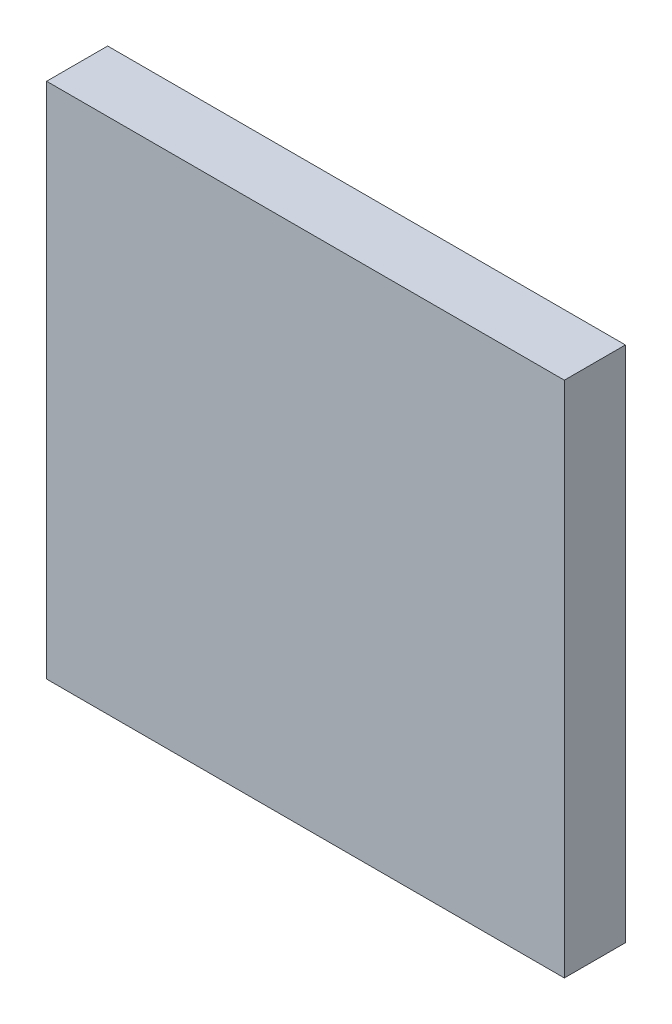
ISO-10303-21;
HEADER;
FILE_DESCRIPTION(('STEP AP214'),'2;1');
FILE_NAME('part.step','',(''),(''),'','','');
FILE_SCHEMA(('AUTOMOTIVE_DESIGN { 1 0 10303 214 1 1 1 1 }'));
ENDSEC;
DATA;
#1=APPLICATION_CONTEXT('core data for automotive mechanical design processes');
#2=APPLICATION_PROTOCOL_DEFINITION('international standard','automotive_design',2000,#1);
#3=PRODUCT_CONTEXT('',#1,'mechanical');
#4=PRODUCT('Part','Part','',(#3));
#5=PRODUCT_RELATED_PRODUCT_CATEGORY('part','',(#4));
#6=PRODUCT_DEFINITION_FORMATION('','',#4);
#7=PRODUCT_DEFINITION_CONTEXT('part definition',#1,'design');
#8=PRODUCT_DEFINITION('design','',#6,#7);
#9=PRODUCT_DEFINITION_SHAPE('','',#8);
#10=(LENGTH_UNIT() NAMED_UNIT(*) SI_UNIT(.MILLI.,.METRE.));
#11=(NAMED_UNIT(*) PLANE_ANGLE_UNIT() SI_UNIT($,.RADIAN.));
#12=(NAMED_UNIT(*) SI_UNIT($,.STERADIAN.) SOLID_ANGLE_UNIT());
#13=UNCERTAINTY_MEASURE_WITH_UNIT(LENGTH_MEASURE(1.E-05),#10,'distance_accuracy_value','');
#14=(GEOMETRIC_REPRESENTATION_CONTEXT(3) GLOBAL_UNCERTAINTY_ASSIGNED_CONTEXT((#13)) GLOBAL_UNIT_ASSIGNED_CONTEXT((#10,
#11,#12)) REPRESENTATION_CONTEXT('',''));
#15=CARTESIAN_POINT('',(0.,0.,0.));
#16=DIRECTION('',(0.,0.,1.));
#17=DIRECTION('',(1.,0.,0.));
#18=AXIS2_PLACEMENT_3D('',#15,#16,#17);
#19=CARTESIAN_POINT('',(0.359731676890786,-12.3662846645274,44.21209652793));
#20=DIRECTION('',(0.,1.,0.));
#21=DIRECTION('',(0.,0.,1.));
#22=AXIS2_PLACEMENT_3D('',#19,#20,#21);
#23=PLANE('',#22);
#24=DIRECTION('',(0.,0.,-1.));
#25=VECTOR('',#24,1.);
#26=CARTESIAN_POINT('',(0.359731676890786,-12.3662846645274,44.21209652793));
#27=LINE('',#26,#25);
#28=CARTESIAN_POINT('',(0.359731676890786,-12.3662846645274,44.21209652793));
#29=VERTEX_POINT('',#28);
#30=CARTESIAN_POINT('',(0.359731676890786,-12.3662846645274,43.6520965279299));
#31=VERTEX_POINT('',#30);
#32=EDGE_CURVE('E42',#29,#31,#27,.T.);
#33=ORIENTED_EDGE('',*,*,#32,.F.);
#34=DIRECTION('',(-1.,0.,0.));
#35=VECTOR('',#34,1.);
#36=CARTESIAN_POINT('',(0.359731676890786,-12.3662846645274,44.21209652793));
#37=LINE('',#36,#35);
#38=CARTESIAN_POINT('',(-4.39026832310921,-12.3662846645274,44.21209652793));
#39=VERTEX_POINT('',#38);
#40=EDGE_CURVE('E70',#29,#39,#37,.T.);
#41=ORIENTED_EDGE('',*,*,#40,.T.);
#42=DIRECTION('',(0.,0.,-1.));
#43=VECTOR('',#42,1.);
#44=CARTESIAN_POINT('',(-4.39026832310921,-12.3662846645274,44.21209652793));
#45=LINE('',#44,#43);
#46=CARTESIAN_POINT('',(-4.39026832310921,-12.3662846645274,43.6520965279299));
#47=VERTEX_POINT('',#46);
#48=EDGE_CURVE('E21',#39,#47,#45,.T.);
#49=ORIENTED_EDGE('',*,*,#48,.T.);
#50=DIRECTION('',(1.,0.,0.));
#51=VECTOR('',#50,1.);
#52=CARTESIAN_POINT('',(0.359731676890786,-12.3662846645274,43.6520965279299));
#53=LINE('',#52,#51);
#54=EDGE_CURVE('E27',#47,#31,#53,.T.);
#55=ORIENTED_EDGE('',*,*,#54,.T.);
#56=EDGE_LOOP('',(#33,#41,#49,#55));
#57=FACE_BOUND('',#56,.T.);
#58=ADVANCED_FACE('F17',(#57),#23,.F.);
#59=CARTESIAN_POINT('',(0.,0.,44.21209652793));
#60=DIRECTION('',(0.,0.,1.));
#61=DIRECTION('',(1.,0.,0.));
#62=AXIS2_PLACEMENT_3D('',#59,#60,#61);
#63=PLANE('',#62);
#64=DIRECTION('',(0.,1.,0.));
#65=VECTOR('',#64,1.);
#66=CARTESIAN_POINT('',(0.359731676890786,-12.3662846645274,44.21209652793));
#67=LINE('',#66,#65);
#68=CARTESIAN_POINT('',(0.359731676890786,-7.61628466452741,44.21209652793));
#69=VERTEX_POINT('',#68);
#70=EDGE_CURVE('E86',#29,#69,#67,.T.);
#71=ORIENTED_EDGE('',*,*,#70,.T.);
#72=DIRECTION('',(1.,0.,0.));
#73=VECTOR('',#72,1.);
#74=CARTESIAN_POINT('',(-4.39026832310921,-7.61628466452742,44.21209652793));
#75=LINE('',#74,#73);
#76=CARTESIAN_POINT('',(-4.39026832310921,-7.61628466452742,44.21209652793));
#77=VERTEX_POINT('',#76);
#78=EDGE_CURVE('E65',#77,#69,#75,.T.);
#79=ORIENTED_EDGE('',*,*,#78,.F.);
#80=DIRECTION('',(0.,1.,0.));
#81=VECTOR('',#80,1.);
#82=CARTESIAN_POINT('',(-4.39026832310921,-12.3662846645274,44.21209652793));
#83=LINE('',#82,#81);
#84=EDGE_CURVE('E62',#39,#77,#83,.T.);
#85=ORIENTED_EDGE('',*,*,#84,.F.);
#86=ORIENTED_EDGE('',*,*,#40,.F.);
#87=EDGE_LOOP('',(#71,#79,#85,#86));
#88=FACE_BOUND('',#87,.T.);
#89=ADVANCED_FACE('F69',(#88),#63,.T.);
#90=CARTESIAN_POINT('',(0.,0.,43.6520965279299));
#91=DIRECTION('',(0.,0.,1.));
#92=DIRECTION('',(1.,0.,0.));
#93=AXIS2_PLACEMENT_3D('',#90,#91,#92);
#94=PLANE('',#93);
#95=DIRECTION('',(0.,-1.,0.));
#96=VECTOR('',#95,1.);
#97=CARTESIAN_POINT('',(-4.39026832310921,-12.3662846645274,43.6520965279299));
#98=LINE('',#97,#96);
#99=CARTESIAN_POINT('',(-4.39026832310921,-7.61628466452742,43.6520965279299));
#100=VERTEX_POINT('',#99);
#101=EDGE_CURVE('E11',#100,#47,#98,.T.);
#102=ORIENTED_EDGE('',*,*,#101,.F.);
#103=DIRECTION('',(-1.,0.,0.));
#104=VECTOR('',#103,1.);
#105=CARTESIAN_POINT('',(0.359731676890786,-7.61628466452741,43.6520965279299));
#106=LINE('',#105,#104);
#107=CARTESIAN_POINT('',(0.359731676890786,-7.61628466452741,43.6520965279299));
#108=VERTEX_POINT('',#107);
#109=EDGE_CURVE('E81',#108,#100,#106,.T.);
#110=ORIENTED_EDGE('',*,*,#109,.F.);
#111=DIRECTION('',(0.,1.,0.));
#112=VECTOR('',#111,1.);
#113=CARTESIAN_POINT('',(0.359731676890786,-12.3662846645274,43.6520965279299));
#114=LINE('',#113,#112);
#115=EDGE_CURVE('E85',#31,#108,#114,.T.);
#116=ORIENTED_EDGE('',*,*,#115,.F.);
#117=ORIENTED_EDGE('',*,*,#54,.F.);
#118=EDGE_LOOP('',(#102,#110,#116,#117));
#119=FACE_BOUND('',#118,.T.);
#120=ADVANCED_FACE('F106',(#119),#94,.F.);
#121=CARTESIAN_POINT('',(0.359731676890786,-12.3662846645274,44.21209652793));
#122=DIRECTION('',(-1.,0.,0.));
#123=DIRECTION('',(0.,0.,1.));
#124=AXIS2_PLACEMENT_3D('',#121,#122,#123);
#125=PLANE('',#124);
#126=ORIENTED_EDGE('',*,*,#70,.F.);
#127=ORIENTED_EDGE('',*,*,#32,.T.);
#128=ORIENTED_EDGE('',*,*,#115,.T.);
#129=DIRECTION('',(0.,0.,-1.));
#130=VECTOR('',#129,1.);
#131=CARTESIAN_POINT('',(0.359731676890786,-7.61628466452741,44.21209652793));
#132=LINE('',#131,#130);
#133=EDGE_CURVE('E95',#69,#108,#132,.T.);
#134=ORIENTED_EDGE('',*,*,#133,.F.);
#135=EDGE_LOOP('',(#126,#127,#128,#134));
#136=FACE_BOUND('',#135,.T.);
#137=ADVANCED_FACE('F104',(#136),#125,.F.);
#138=CARTESIAN_POINT('',(-4.39026832310921,-12.3662846645274,44.21209652793));
#139=DIRECTION('',(1.,0.,0.));
#140=DIRECTION('',(0.,0.,-1.));
#141=AXIS2_PLACEMENT_3D('',#138,#139,#140);
#142=PLANE('',#141);
#143=ORIENTED_EDGE('',*,*,#48,.F.);
#144=ORIENTED_EDGE('',*,*,#84,.T.);
#145=DIRECTION('',(0.,0.,-1.));
#146=VECTOR('',#145,1.);
#147=CARTESIAN_POINT('',(-4.39026832310921,-7.61628466452742,44.21209652793));
#148=LINE('',#147,#146);
#149=EDGE_CURVE('E92',#77,#100,#148,.T.);
#150=ORIENTED_EDGE('',*,*,#149,.T.);
#151=ORIENTED_EDGE('',*,*,#101,.T.);
#152=EDGE_LOOP('',(#143,#144,#150,#151));
#153=FACE_BOUND('',#152,.T.);
#154=ADVANCED_FACE('F61',(#153),#142,.F.);
#155=CARTESIAN_POINT('',(0.359731676890786,-7.61628466452741,44.21209652793));
#156=DIRECTION('',(0.,-1.,0.));
#157=DIRECTION('',(1.,0.,0.));
#158=AXIS2_PLACEMENT_3D('',#155,#156,#157);
#159=PLANE('',#158);
#160=ORIENTED_EDGE('',*,*,#149,.F.);
#161=ORIENTED_EDGE('',*,*,#78,.T.);
#162=ORIENTED_EDGE('',*,*,#133,.T.);
#163=ORIENTED_EDGE('',*,*,#109,.T.);
#164=EDGE_LOOP('',(#160,#161,#162,#163));
#165=FACE_BOUND('',#164,.T.);
#166=ADVANCED_FACE('F19',(#165),#159,.F.);
#167=CLOSED_SHELL('',(#58,#89,#120,#137,#154,#166));
#168=MANIFOLD_SOLID_BREP('B1',#167);
#169=ADVANCED_BREP_SHAPE_REPRESENTATION('',(#18,#168),#14);
#170=SHAPE_DEFINITION_REPRESENTATION(#9,#169);
ENDSEC;
END-ISO-10303-21;
